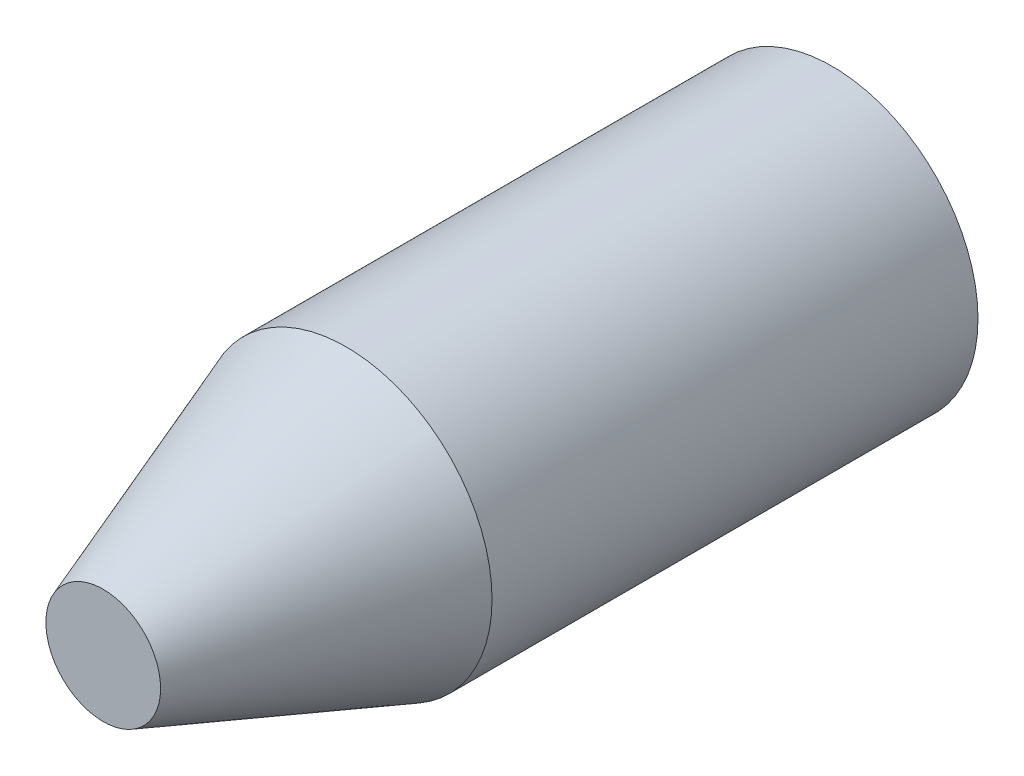
ISO-10303-21;
HEADER;
FILE_DESCRIPTION(('STEP AP214'),'2;1');
FILE_NAME('part.step','',(''),(''),'','','');
FILE_SCHEMA(('AUTOMOTIVE_DESIGN { 1 0 10303 214 1 1 1 1 }'));
ENDSEC;
DATA;
#1=APPLICATION_CONTEXT('core data for automotive mechanical design processes');
#2=APPLICATION_PROTOCOL_DEFINITION('international standard','automotive_design',2000,#1);
#3=PRODUCT_CONTEXT('',#1,'mechanical');
#4=PRODUCT('Part','Part','',(#3));
#5=PRODUCT_RELATED_PRODUCT_CATEGORY('part','',(#4));
#6=PRODUCT_DEFINITION_FORMATION('','',#4);
#7=PRODUCT_DEFINITION_CONTEXT('part definition',#1,'design');
#8=PRODUCT_DEFINITION('design','',#6,#7);
#9=PRODUCT_DEFINITION_SHAPE('','',#8);
#10=(LENGTH_UNIT() NAMED_UNIT(*) SI_UNIT(.MILLI.,.METRE.));
#11=(NAMED_UNIT(*) PLANE_ANGLE_UNIT() SI_UNIT($,.RADIAN.));
#12=(NAMED_UNIT(*) SI_UNIT($,.STERADIAN.) SOLID_ANGLE_UNIT());
#13=UNCERTAINTY_MEASURE_WITH_UNIT(LENGTH_MEASURE(1.E-05),#10,'distance_accuracy_value','');
#14=(GEOMETRIC_REPRESENTATION_CONTEXT(3) GLOBAL_UNCERTAINTY_ASSIGNED_CONTEXT((#13)) GLOBAL_UNIT_ASSIGNED_CONTEXT((#10,
#11,#12)) REPRESENTATION_CONTEXT('',''));
#15=CARTESIAN_POINT('',(0.,0.,0.));
#16=DIRECTION('',(0.,0.,1.));
#17=DIRECTION('',(1.,0.,0.));
#18=AXIS2_PLACEMENT_3D('',#15,#16,#17);
#19=CARTESIAN_POINT('',(0.,0.,10.));
#20=DIRECTION('',(0.,0.,-1.));
#21=DIRECTION('',(-1.,0.,0.));
#22=AXIS2_PLACEMENT_3D('',#19,#20,#21);
#23=CYLINDRICAL_SURFACE('',#22,3.);
#24=CARTESIAN_POINT('',(0.,0.,10.));
#25=DIRECTION('',(0.,0.,1.));
#26=DIRECTION('',(1.,0.,0.));
#27=AXIS2_PLACEMENT_3D('',#24,#25,#26);
#28=CIRCLE('',#27,3.);
#29=CARTESIAN_POINT('',(3.,0.,10.));
#30=VERTEX_POINT('',#29);
#31=EDGE_CURVE('E10',#30,#30,#28,.T.);
#32=ORIENTED_EDGE('',*,*,#31,.F.);
#33=EDGE_LOOP('',(#32));
#34=FACE_BOUND('',#33,.T.);
#35=CARTESIAN_POINT('',(0.,0.,0.));
#36=DIRECTION('',(0.,0.,1.));
#37=DIRECTION('',(1.,0.,0.));
#38=AXIS2_PLACEMENT_3D('',#35,#36,#37);
#39=CIRCLE('',#38,3.);
#40=CARTESIAN_POINT('',(3.,0.,0.));
#41=VERTEX_POINT('',#40);
#42=EDGE_CURVE('E38',#41,#41,#39,.T.);
#43=ORIENTED_EDGE('',*,*,#42,.T.);
#44=EDGE_LOOP('',(#43));
#45=FACE_BOUND('',#44,.T.);
#46=ADVANCED_FACE('F35',(#34,#45),#23,.T.);
#47=CARTESIAN_POINT('',(0.,0.,0.));
#48=DIRECTION('',(0.,0.,1.));
#49=DIRECTION('',(1.,0.,0.));
#50=AXIS2_PLACEMENT_3D('',#47,#48,#49);
#51=PLANE('',#50);
#52=ORIENTED_EDGE('',*,*,#42,.F.);
#53=EDGE_LOOP('',(#52));
#54=FACE_BOUND('',#53,.T.);
#55=ADVANCED_FACE('F54',(#54),#51,.F.);
#56=CARTESIAN_POINT('',(0.,0.,10.));
#57=DIRECTION('',(0.,0.,-1.));
#58=DIRECTION('',(1.,0.,0.));
#59=AXIS2_PLACEMENT_3D('',#56,#57,#58);
#60=CONICAL_SURFACE('',#59,3.,0.349065850398867);
#61=CARTESIAN_POINT('',(0.,0.,15.));
#62=DIRECTION('',(0.,0.,1.));
#63=DIRECTION('',(1.,0.,0.));
#64=AXIS2_PLACEMENT_3D('',#61,#62,#63);
#65=CIRCLE('',#64,1.18014882866898);
#66=CARTESIAN_POINT('',(1.18014882866898,0.,15.));
#67=VERTEX_POINT('',#66);
#68=EDGE_CURVE('E45',#67,#67,#65,.T.);
#69=ORIENTED_EDGE('',*,*,#68,.F.);
#70=EDGE_LOOP('',(#69));
#71=FACE_BOUND('',#70,.T.);
#72=ORIENTED_EDGE('',*,*,#31,.T.);
#73=EDGE_LOOP('',(#72));
#74=FACE_BOUND('',#73,.T.);
#75=ADVANCED_FACE('F52',(#71,#74),#60,.T.);
#76=CARTESIAN_POINT('',(0.,0.,15.));
#77=DIRECTION('',(0.,0.,1.));
#78=DIRECTION('',(1.,0.,0.));
#79=AXIS2_PLACEMENT_3D('',#76,#77,#78);
#80=PLANE('',#79);
#81=ORIENTED_EDGE('',*,*,#68,.T.);
#82=EDGE_LOOP('',(#81));
#83=FACE_BOUND('',#82,.T.);
#84=ADVANCED_FACE('F50',(#83),#80,.T.);
#85=CLOSED_SHELL('',(#46,#55,#75,#84));
#86=MANIFOLD_SOLID_BREP('B2',#85);
#87=ADVANCED_BREP_SHAPE_REPRESENTATION('',(#18,#86),#14);
#88=SHAPE_DEFINITION_REPRESENTATION(#9,#87);
ENDSEC;
END-ISO-10303-21;
